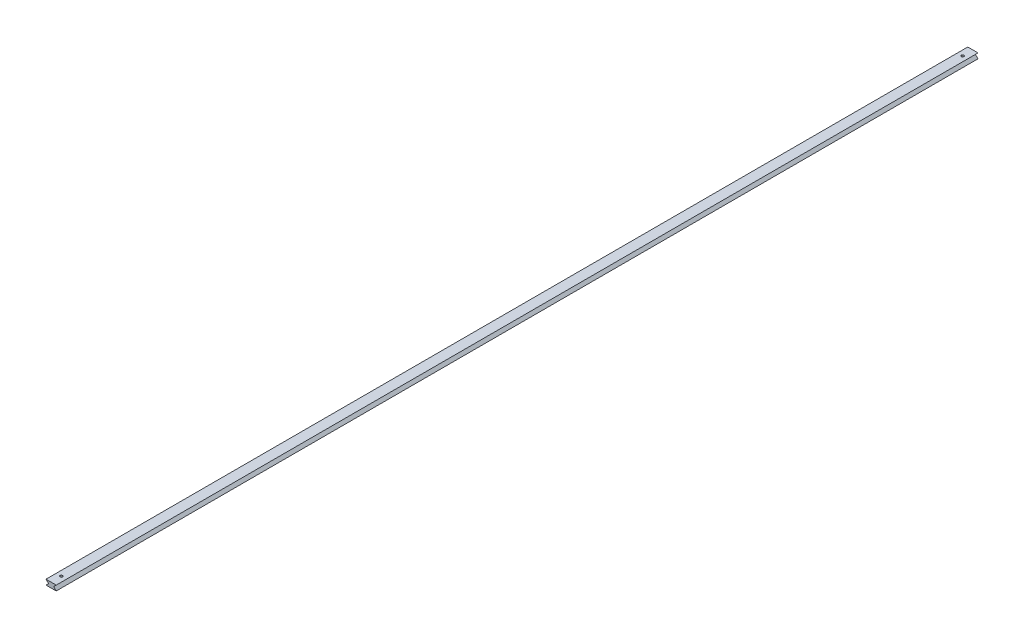
ISO-10303-21;
HEADER;
FILE_DESCRIPTION(('STEP AP214'),'2;1');
FILE_NAME('part.step','',(''),(''),'','','');
FILE_SCHEMA(('AUTOMOTIVE_DESIGN { 1 0 10303 214 1 1 1 1 }'));
ENDSEC;
DATA;
#1=APPLICATION_CONTEXT('core data for automotive mechanical design processes');
#2=APPLICATION_PROTOCOL_DEFINITION('international standard','automotive_design',2000,#1);
#3=PRODUCT_CONTEXT('',#1,'mechanical');
#4=PRODUCT('Part','Part','',(#3));
#5=PRODUCT_RELATED_PRODUCT_CATEGORY('part','',(#4));
#6=PRODUCT_DEFINITION_FORMATION('','',#4);
#7=PRODUCT_DEFINITION_CONTEXT('part definition',#1,'design');
#8=PRODUCT_DEFINITION('design','',#6,#7);
#9=PRODUCT_DEFINITION_SHAPE('','',#8);
#10=(LENGTH_UNIT() NAMED_UNIT(*) SI_UNIT(.MILLI.,.METRE.));
#11=(NAMED_UNIT(*) PLANE_ANGLE_UNIT() SI_UNIT($,.RADIAN.));
#12=(NAMED_UNIT(*) SI_UNIT($,.STERADIAN.) SOLID_ANGLE_UNIT());
#13=UNCERTAINTY_MEASURE_WITH_UNIT(LENGTH_MEASURE(1.E-05),#10,'distance_accuracy_value','');
#14=(GEOMETRIC_REPRESENTATION_CONTEXT(3) GLOBAL_UNCERTAINTY_ASSIGNED_CONTEXT((#13)) GLOBAL_UNIT_ASSIGNED_CONTEXT((#10,
#11,#12)) REPRESENTATION_CONTEXT('',''));
#15=CARTESIAN_POINT('',(0.,0.,0.));
#16=DIRECTION('',(0.,0.,1.));
#17=DIRECTION('',(1.,0.,0.));
#18=AXIS2_PLACEMENT_3D('',#15,#16,#17);
#19=CARTESIAN_POINT('',(5.00000000000005,-5.,1800.));
#20=DIRECTION('',(0.707106781186544,0.707106781186551,0.));
#21=DIRECTION('',(-0.707106781186551,0.707106781186544,0.));
#22=AXIS2_PLACEMENT_3D('',#19,#20,#21);
#23=PLANE('',#22);
#24=DIRECTION('',(0.707106781186551,-0.707106781186544,0.));
#25=VECTOR('',#24,1.);
#26=CARTESIAN_POINT('',(5.00000000000005,-5.,0.));
#27=LINE('',#26,#25);
#28=CARTESIAN_POINT('',(0.,0.,0.));
#29=VERTEX_POINT('',#28);
#30=CARTESIAN_POINT('',(5.00000000000005,-5.,0.));
#31=VERTEX_POINT('',#30);
#32=EDGE_CURVE('E116',#29,#31,#27,.T.);
#33=ORIENTED_EDGE('',*,*,#32,.T.);
#34=DIRECTION('',(0.,0.,-1.));
#35=VECTOR('',#34,1.);
#36=CARTESIAN_POINT('',(5.00000000000005,-5.,1800.));
#37=LINE('',#36,#35);
#38=CARTESIAN_POINT('',(5.00000000000005,-5.,1800.));
#39=VERTEX_POINT('',#38);
#40=EDGE_CURVE('E11',#39,#31,#37,.T.);
#41=ORIENTED_EDGE('',*,*,#40,.F.);
#42=DIRECTION('',(0.707106781186551,-0.707106781186544,0.));
#43=VECTOR('',#42,1.);
#44=CARTESIAN_POINT('',(5.00000000000005,-5.,1800.));
#45=LINE('',#44,#43);
#46=CARTESIAN_POINT('',(0.,0.,1800.));
#47=VERTEX_POINT('',#46);
#48=EDGE_CURVE('E127',#47,#39,#45,.T.);
#49=ORIENTED_EDGE('',*,*,#48,.F.);
#50=DIRECTION('',(0.,0.,-1.));
#51=VECTOR('',#50,1.);
#52=CARTESIAN_POINT('',(0.,0.,1800.));
#53=LINE('',#52,#51);
#54=EDGE_CURVE('E112',#47,#29,#53,.T.);
#55=ORIENTED_EDGE('',*,*,#54,.T.);
#56=EDGE_LOOP('',(#33,#41,#49,#55));
#57=FACE_BOUND('',#56,.T.);
#58=ADVANCED_FACE('F32',(#57),#23,.F.);
#59=CARTESIAN_POINT('',(0.,-10.,1800.));
#60=DIRECTION('',(0.707106781186544,-0.707106781186551,0.));
#61=DIRECTION('',(0.707106781186551,0.707106781186544,0.));
#62=AXIS2_PLACEMENT_3D('',#59,#60,#61);
#63=PLANE('',#62);
#64=DIRECTION('',(-0.707106781186551,-0.707106781186544,0.));
#65=VECTOR('',#64,1.);
#66=CARTESIAN_POINT('',(0.,-10.,0.));
#67=LINE('',#66,#65);
#68=CARTESIAN_POINT('',(0.,-10.,0.));
#69=VERTEX_POINT('',#68);
#70=EDGE_CURVE('E119',#31,#69,#67,.T.);
#71=ORIENTED_EDGE('',*,*,#70,.T.);
#72=DIRECTION('',(0.,0.,-1.));
#73=VECTOR('',#72,1.);
#74=CARTESIAN_POINT('',(0.,-10.,1800.));
#75=LINE('',#74,#73);
#76=CARTESIAN_POINT('',(0.,-10.,1800.));
#77=VERTEX_POINT('',#76);
#78=EDGE_CURVE('E40',#77,#69,#75,.T.);
#79=ORIENTED_EDGE('',*,*,#78,.F.);
#80=DIRECTION('',(-0.707106781186551,-0.707106781186544,0.));
#81=VECTOR('',#80,1.);
#82=CARTESIAN_POINT('',(0.,-10.,1800.));
#83=LINE('',#82,#81);
#84=EDGE_CURVE('E85',#39,#77,#83,.T.);
#85=ORIENTED_EDGE('',*,*,#84,.F.);
#86=ORIENTED_EDGE('',*,*,#40,.T.);
#87=EDGE_LOOP('',(#71,#79,#85,#86));
#88=FACE_BOUND('',#87,.T.);
#89=ADVANCED_FACE('F154',(#88),#63,.F.);
#90=CARTESIAN_POINT('',(20.,-10.,1800.));
#91=DIRECTION('',(0.,1.,0.));
#92=DIRECTION('',(0.,0.,1.));
#93=AXIS2_PLACEMENT_3D('',#90,#91,#92);
#94=PLANE('',#93);
#95=CARTESIAN_POINT('',(10.,-10.,1780.));
#96=DIRECTION('',(0.,1.,0.));
#97=DIRECTION('',(0.,0.,1.));
#98=AXIS2_PLACEMENT_3D('',#95,#96,#97);
#99=CIRCLE('',#98,2.49999999999997);
#100=CARTESIAN_POINT('',(10.,-10.,1782.5));
#101=VERTEX_POINT('',#100);
#102=EDGE_CURVE('E222',#101,#101,#99,.T.);
#103=ORIENTED_EDGE('',*,*,#102,.T.);
#104=EDGE_LOOP('',(#103));
#105=FACE_BOUND('',#104,.T.);
#106=CARTESIAN_POINT('',(10.,-10.,20.));
#107=DIRECTION('',(0.,1.,0.));
#108=DIRECTION('',(0.,0.,1.));
#109=AXIS2_PLACEMENT_3D('',#106,#107,#108);
#110=CIRCLE('',#109,2.5);
#111=CARTESIAN_POINT('',(10.,-10.,22.5));
#112=VERTEX_POINT('',#111);
#113=EDGE_CURVE('E120',#112,#112,#110,.T.);
#114=ORIENTED_EDGE('',*,*,#113,.T.);
#115=EDGE_LOOP('',(#114));
#116=FACE_BOUND('',#115,.T.);
#117=DIRECTION('',(1.,0.,0.));
#118=VECTOR('',#117,1.);
#119=CARTESIAN_POINT('',(20.,-10.,0.));
#120=LINE('',#119,#118);
#121=CARTESIAN_POINT('',(20.,-10.,0.));
#122=VERTEX_POINT('',#121);
#123=EDGE_CURVE('E122',#69,#122,#120,.T.);
#124=ORIENTED_EDGE('',*,*,#123,.T.);
#125=DIRECTION('',(0.,0.,-1.));
#126=VECTOR('',#125,1.);
#127=CARTESIAN_POINT('',(20.,-10.,1800.));
#128=LINE('',#127,#126);
#129=CARTESIAN_POINT('',(20.,-10.,1800.));
#130=VERTEX_POINT('',#129);
#131=EDGE_CURVE('E107',#130,#122,#128,.T.);
#132=ORIENTED_EDGE('',*,*,#131,.F.);
#133=DIRECTION('',(1.,0.,0.));
#134=VECTOR('',#133,1.);
#135=CARTESIAN_POINT('',(20.,-10.,1800.));
#136=LINE('',#135,#134);
#137=EDGE_CURVE('E98',#77,#130,#136,.T.);
#138=ORIENTED_EDGE('',*,*,#137,.F.);
#139=ORIENTED_EDGE('',*,*,#78,.T.);
#140=EDGE_LOOP('',(#124,#132,#138,#139));
#141=FACE_BOUND('',#140,.T.);
#142=ADVANCED_FACE('F133',(#105,#116,#141),#94,.F.);
#143=CARTESIAN_POINT('',(15.,-5.,1800.));
#144=DIRECTION('',(-0.707106781186544,-0.707106781186551,0.));
#145=DIRECTION('',(0.707106781186551,-0.707106781186544,0.));
#146=AXIS2_PLACEMENT_3D('',#143,#144,#145);
#147=PLANE('',#146);
#148=DIRECTION('',(-0.707106781186551,0.707106781186544,0.));
#149=VECTOR('',#148,1.);
#150=CARTESIAN_POINT('',(15.,-5.,0.));
#151=LINE('',#150,#149);
#152=CARTESIAN_POINT('',(15.,-5.,0.));
#153=VERTEX_POINT('',#152);
#154=EDGE_CURVE('E106',#122,#153,#151,.T.);
#155=ORIENTED_EDGE('',*,*,#154,.T.);
#156=DIRECTION('',(0.,0.,-1.));
#157=VECTOR('',#156,1.);
#158=CARTESIAN_POINT('',(15.,-5.,1800.));
#159=LINE('',#158,#157);
#160=CARTESIAN_POINT('',(15.,-5.,1800.));
#161=VERTEX_POINT('',#160);
#162=EDGE_CURVE('E103',#161,#153,#159,.T.);
#163=ORIENTED_EDGE('',*,*,#162,.F.);
#164=DIRECTION('',(-0.707106781186551,0.707106781186544,0.));
#165=VECTOR('',#164,1.);
#166=CARTESIAN_POINT('',(15.,-5.,1800.));
#167=LINE('',#166,#165);
#168=EDGE_CURVE('E92',#130,#161,#167,.T.);
#169=ORIENTED_EDGE('',*,*,#168,.F.);
#170=ORIENTED_EDGE('',*,*,#131,.T.);
#171=EDGE_LOOP('',(#155,#163,#169,#170));
#172=FACE_BOUND('',#171,.T.);
#173=ADVANCED_FACE('F104',(#172),#147,.F.);
#174=CARTESIAN_POINT('',(20.,0.,1800.));
#175=DIRECTION('',(-0.707106781186544,0.707106781186551,0.));
#176=DIRECTION('',(-0.707106781186551,-0.707106781186544,0.));
#177=AXIS2_PLACEMENT_3D('',#174,#175,#176);
#178=PLANE('',#177);
#179=DIRECTION('',(0.707106781186551,0.707106781186544,0.));
#180=VECTOR('',#179,1.);
#181=CARTESIAN_POINT('',(20.,0.,0.));
#182=LINE('',#181,#180);
#183=CARTESIAN_POINT('',(20.,0.,0.));
#184=VERTEX_POINT('',#183);
#185=EDGE_CURVE('E71',#153,#184,#182,.T.);
#186=ORIENTED_EDGE('',*,*,#185,.T.);
#187=DIRECTION('',(0.,0.,-1.));
#188=VECTOR('',#187,1.);
#189=CARTESIAN_POINT('',(20.,0.,1800.));
#190=LINE('',#189,#188);
#191=CARTESIAN_POINT('',(20.,0.,1800.));
#192=VERTEX_POINT('',#191);
#193=EDGE_CURVE('E108',#192,#184,#190,.T.);
#194=ORIENTED_EDGE('',*,*,#193,.F.);
#195=DIRECTION('',(0.707106781186551,0.707106781186544,0.));
#196=VECTOR('',#195,1.);
#197=CARTESIAN_POINT('',(20.,0.,1800.));
#198=LINE('',#197,#196);
#199=EDGE_CURVE('E96',#161,#192,#198,.T.);
#200=ORIENTED_EDGE('',*,*,#199,.F.);
#201=ORIENTED_EDGE('',*,*,#162,.T.);
#202=EDGE_LOOP('',(#186,#194,#200,#201));
#203=FACE_BOUND('',#202,.T.);
#204=ADVANCED_FACE('F110',(#203),#178,.F.);
#205=CARTESIAN_POINT('',(0.,0.,1800.));
#206=DIRECTION('',(0.,-1.,0.));
#207=DIRECTION('',(0.,0.,-1.));
#208=AXIS2_PLACEMENT_3D('',#205,#206,#207);
#209=PLANE('',#208);
#210=CARTESIAN_POINT('',(10.,0.,1780.));
#211=DIRECTION('',(0.,1.,0.));
#212=DIRECTION('',(0.,0.,1.));
#213=AXIS2_PLACEMENT_3D('',#210,#211,#212);
#214=CIRCLE('',#213,2.49999999999997);
#215=CARTESIAN_POINT('',(10.,0.,1782.5));
#216=VERTEX_POINT('',#215);
#217=EDGE_CURVE('E224',#216,#216,#214,.T.);
#218=ORIENTED_EDGE('',*,*,#217,.F.);
#219=EDGE_LOOP('',(#218));
#220=FACE_BOUND('',#219,.T.);
#221=CARTESIAN_POINT('',(10.,0.,20.));
#222=DIRECTION('',(0.,1.,0.));
#223=DIRECTION('',(0.,0.,1.));
#224=AXIS2_PLACEMENT_3D('',#221,#222,#223);
#225=CIRCLE('',#224,2.5);
#226=CARTESIAN_POINT('',(10.,0.,22.5));
#227=VERTEX_POINT('',#226);
#228=EDGE_CURVE('E226',#227,#227,#225,.T.);
#229=ORIENTED_EDGE('',*,*,#228,.F.);
#230=EDGE_LOOP('',(#229));
#231=FACE_BOUND('',#230,.T.);
#232=DIRECTION('',(-1.,0.,0.));
#233=VECTOR('',#232,1.);
#234=CARTESIAN_POINT('',(0.,0.,0.));
#235=LINE('',#234,#233);
#236=EDGE_CURVE('E77',#184,#29,#235,.T.);
#237=ORIENTED_EDGE('',*,*,#236,.T.);
#238=ORIENTED_EDGE('',*,*,#54,.F.);
#239=DIRECTION('',(-1.,0.,0.));
#240=VECTOR('',#239,1.);
#241=CARTESIAN_POINT('',(0.,0.,1800.));
#242=LINE('',#241,#240);
#243=EDGE_CURVE('E48',#192,#47,#242,.T.);
#244=ORIENTED_EDGE('',*,*,#243,.F.);
#245=ORIENTED_EDGE('',*,*,#193,.T.);
#246=EDGE_LOOP('',(#237,#238,#244,#245));
#247=FACE_BOUND('',#246,.T.);
#248=ADVANCED_FACE('F140',(#220,#231,#247),#209,.F.);
#249=CARTESIAN_POINT('',(0.,0.,1800.));
#250=DIRECTION('',(0.,0.,1.));
#251=DIRECTION('',(1.,0.,0.));
#252=AXIS2_PLACEMENT_3D('',#249,#250,#251);
#253=PLANE('',#252);
#254=ORIENTED_EDGE('',*,*,#48,.T.);
#255=ORIENTED_EDGE('',*,*,#84,.T.);
#256=ORIENTED_EDGE('',*,*,#137,.T.);
#257=ORIENTED_EDGE('',*,*,#168,.T.);
#258=ORIENTED_EDGE('',*,*,#199,.T.);
#259=ORIENTED_EDGE('',*,*,#243,.T.);
#260=EDGE_LOOP('',(#254,#255,#256,#257,#258,#259));
#261=FACE_BOUND('',#260,.T.);
#262=ADVANCED_FACE('F94',(#261),#253,.T.);
#263=CARTESIAN_POINT('',(0.,0.,0.));
#264=DIRECTION('',(0.,0.,1.));
#265=DIRECTION('',(1.,0.,0.));
#266=AXIS2_PLACEMENT_3D('',#263,#264,#265);
#267=PLANE('',#266);
#268=ORIENTED_EDGE('',*,*,#32,.F.);
#269=ORIENTED_EDGE('',*,*,#236,.F.);
#270=ORIENTED_EDGE('',*,*,#185,.F.);
#271=ORIENTED_EDGE('',*,*,#154,.F.);
#272=ORIENTED_EDGE('',*,*,#123,.F.);
#273=ORIENTED_EDGE('',*,*,#70,.F.);
#274=EDGE_LOOP('',(#268,#269,#270,#271,#272,#273));
#275=FACE_BOUND('',#274,.T.);
#276=ADVANCED_FACE('F136',(#275),#267,.F.);
#277=CARTESIAN_POINT('',(10.,-10.,20.));
#278=DIRECTION('',(0.,1.,0.));
#279=DIRECTION('',(0.,0.,1.));
#280=AXIS2_PLACEMENT_3D('',#277,#278,#279);
#281=CYLINDRICAL_SURFACE('',#280,2.5);
#282=ORIENTED_EDGE('',*,*,#113,.F.);
#283=EDGE_LOOP('',(#282));
#284=FACE_BOUND('',#283,.T.);
#285=ORIENTED_EDGE('',*,*,#228,.T.);
#286=EDGE_LOOP('',(#285));
#287=FACE_BOUND('',#286,.T.);
#288=ADVANCED_FACE('F188',(#284,#287),#281,.F.);
#289=CARTESIAN_POINT('',(10.,-10.,1780.));
#290=DIRECTION('',(0.,1.,0.));
#291=DIRECTION('',(0.,0.,1.));
#292=AXIS2_PLACEMENT_3D('',#289,#290,#291);
#293=CYLINDRICAL_SURFACE('',#292,2.49999999999997);
#294=ORIENTED_EDGE('',*,*,#102,.F.);
#295=EDGE_LOOP('',(#294));
#296=FACE_BOUND('',#295,.T.);
#297=ORIENTED_EDGE('',*,*,#217,.T.);
#298=EDGE_LOOP('',(#297));
#299=FACE_BOUND('',#298,.T.);
#300=ADVANCED_FACE('F205',(#296,#299),#293,.F.);
#301=CLOSED_SHELL('',(#58,#89,#142,#173,#204,#248,#262,#276,#288,#300));
#302=MANIFOLD_SOLID_BREP('B2',#301);
#303=ADVANCED_BREP_SHAPE_REPRESENTATION('',(#18,#302),#14);
#304=SHAPE_DEFINITION_REPRESENTATION(#9,#303);
ENDSEC;
END-ISO-10303-21;
